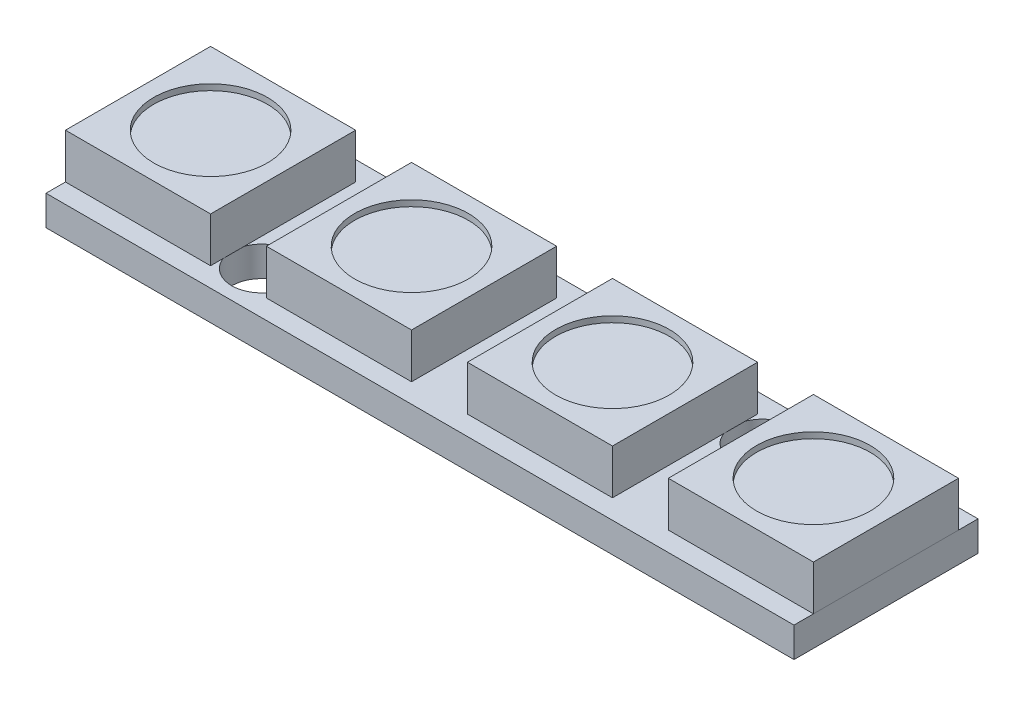
ISO-10303-21;
HEADER;
FILE_DESCRIPTION(('STEP AP214'),'2;1');
FILE_NAME('part.step','',(''),(''),'','','');
FILE_SCHEMA(('AUTOMOTIVE_DESIGN { 1 0 10303 214 1 1 1 1 }'));
ENDSEC;
DATA;
#1=APPLICATION_CONTEXT('core data for automotive mechanical design processes');
#2=APPLICATION_PROTOCOL_DEFINITION('international standard','automotive_design',2000,#1);
#3=PRODUCT_CONTEXT('',#1,'mechanical');
#4=PRODUCT('Part','Part','',(#3));
#5=PRODUCT_RELATED_PRODUCT_CATEGORY('part','',(#4));
#6=PRODUCT_DEFINITION_FORMATION('','',#4);
#7=PRODUCT_DEFINITION_CONTEXT('part definition',#1,'design');
#8=PRODUCT_DEFINITION('design','',#6,#7);
#9=PRODUCT_DEFINITION_SHAPE('','',#8);
#10=(LENGTH_UNIT() NAMED_UNIT(*) SI_UNIT(.MILLI.,.METRE.));
#11=(NAMED_UNIT(*) PLANE_ANGLE_UNIT() SI_UNIT($,.RADIAN.));
#12=(NAMED_UNIT(*) SI_UNIT($,.STERADIAN.) SOLID_ANGLE_UNIT());
#13=UNCERTAINTY_MEASURE_WITH_UNIT(LENGTH_MEASURE(1.E-05),#10,'distance_accuracy_value','');
#14=(GEOMETRIC_REPRESENTATION_CONTEXT(3) GLOBAL_UNCERTAINTY_ASSIGNED_CONTEXT((#13)) GLOBAL_UNIT_ASSIGNED_CONTEXT((#10,
#11,#12)) REPRESENTATION_CONTEXT('',''));
#15=CARTESIAN_POINT('',(0.,0.,0.));
#16=DIRECTION('',(0.,0.,1.));
#17=DIRECTION('',(1.,0.,0.));
#18=AXIS2_PLACEMENT_3D('',#15,#16,#17);
#19=CARTESIAN_POINT('',(7.65,2.5,2.425));
#20=DIRECTION('',(0.,0.,-1.));
#21=DIRECTION('',(-1.,0.,0.));
#22=AXIS2_PLACEMENT_3D('',#19,#20,#21);
#23=PLANE('',#22);
#24=DIRECTION('',(1.,0.,0.));
#25=VECTOR('',#24,1.);
#26=CARTESIAN_POINT('',(7.65,1.,2.425));
#27=LINE('',#26,#25);
#28=CARTESIAN_POINT('',(7.65,1.,2.425));
#29=VERTEX_POINT('',#28);
#30=CARTESIAN_POINT('',(12.5,1.,2.425));
#31=VERTEX_POINT('',#30);
#32=EDGE_CURVE('E111',#29,#31,#27,.T.);
#33=ORIENTED_EDGE('',*,*,#32,.T.);
#34=DIRECTION('',(0.,-1.,0.));
#35=VECTOR('',#34,1.);
#36=CARTESIAN_POINT('',(12.5,2.5,2.425));
#37=LINE('',#36,#35);
#38=CARTESIAN_POINT('',(12.5,2.5,2.425));
#39=VERTEX_POINT('',#38);
#40=EDGE_CURVE('E12',#39,#31,#37,.T.);
#41=ORIENTED_EDGE('',*,*,#40,.F.);
#42=DIRECTION('',(1.,0.,0.));
#43=VECTOR('',#42,1.);
#44=CARTESIAN_POINT('',(7.65,2.5,2.425));
#45=LINE('',#44,#43);
#46=CARTESIAN_POINT('',(7.65,2.5,2.425));
#47=VERTEX_POINT('',#46);
#48=EDGE_CURVE('E99',#47,#39,#45,.T.);
#49=ORIENTED_EDGE('',*,*,#48,.F.);
#50=DIRECTION('',(0.,-1.,0.));
#51=VECTOR('',#50,1.);
#52=CARTESIAN_POINT('',(7.65,2.5,2.425));
#53=LINE('',#52,#51);
#54=EDGE_CURVE('E107',#47,#29,#53,.T.);
#55=ORIENTED_EDGE('',*,*,#54,.T.);
#56=EDGE_LOOP('',(#33,#41,#49,#55));
#57=FACE_BOUND('',#56,.T.);
#58=ADVANCED_FACE('F48',(#57),#23,.F.);
#59=CARTESIAN_POINT('',(12.5,2.5,-2.425));
#60=DIRECTION('',(-1.,0.,0.));
#61=DIRECTION('',(0.,0.,1.));
#62=AXIS2_PLACEMENT_3D('',#59,#60,#61);
#63=PLANE('',#62);
#64=DIRECTION('',(0.,0.,-1.));
#65=VECTOR('',#64,1.);
#66=CARTESIAN_POINT('',(12.5,1.,-2.425));
#67=LINE('',#66,#65);
#68=CARTESIAN_POINT('',(12.5,1.,-2.425));
#69=VERTEX_POINT('',#68);
#70=EDGE_CURVE('E103',#31,#69,#67,.T.);
#71=ORIENTED_EDGE('',*,*,#70,.T.);
#72=DIRECTION('',(0.,-1.,0.));
#73=VECTOR('',#72,1.);
#74=CARTESIAN_POINT('',(12.5,2.5,-2.425));
#75=LINE('',#74,#73);
#76=CARTESIAN_POINT('',(12.5,2.5,-2.425));
#77=VERTEX_POINT('',#76);
#78=EDGE_CURVE('E56',#77,#69,#75,.T.);
#79=ORIENTED_EDGE('',*,*,#78,.F.);
#80=DIRECTION('',(0.,0.,-1.));
#81=VECTOR('',#80,1.);
#82=CARTESIAN_POINT('',(12.5,2.5,-2.425));
#83=LINE('',#82,#81);
#84=EDGE_CURVE('E94',#39,#77,#83,.T.);
#85=ORIENTED_EDGE('',*,*,#84,.F.);
#86=ORIENTED_EDGE('',*,*,#40,.T.);
#87=EDGE_LOOP('',(#71,#79,#85,#86));
#88=FACE_BOUND('',#87,.T.);
#89=ADVANCED_FACE('F102',(#88),#63,.F.);
#90=CARTESIAN_POINT('',(7.65,2.5,-2.425));
#91=DIRECTION('',(0.,0.,1.));
#92=DIRECTION('',(1.,0.,0.));
#93=AXIS2_PLACEMENT_3D('',#90,#91,#92);
#94=PLANE('',#93);
#95=DIRECTION('',(-1.,0.,0.));
#96=VECTOR('',#95,1.);
#97=CARTESIAN_POINT('',(7.65,1.,-2.425));
#98=LINE('',#97,#96);
#99=CARTESIAN_POINT('',(7.65,1.,-2.425));
#100=VERTEX_POINT('',#99);
#101=EDGE_CURVE('E81',#69,#100,#98,.T.);
#102=ORIENTED_EDGE('',*,*,#101,.T.);
#103=DIRECTION('',(0.,-1.,0.));
#104=VECTOR('',#103,1.);
#105=CARTESIAN_POINT('',(7.65,2.5,-2.425));
#106=LINE('',#105,#104);
#107=CARTESIAN_POINT('',(7.65,2.5,-2.425));
#108=VERTEX_POINT('',#107);
#109=EDGE_CURVE('E104',#108,#100,#106,.T.);
#110=ORIENTED_EDGE('',*,*,#109,.F.);
#111=DIRECTION('',(-1.,0.,0.));
#112=VECTOR('',#111,1.);
#113=CARTESIAN_POINT('',(7.65,2.5,-2.425));
#114=LINE('',#113,#112);
#115=EDGE_CURVE('E97',#77,#108,#114,.T.);
#116=ORIENTED_EDGE('',*,*,#115,.F.);
#117=ORIENTED_EDGE('',*,*,#78,.T.);
#118=EDGE_LOOP('',(#102,#110,#116,#117));
#119=FACE_BOUND('',#118,.T.);
#120=ADVANCED_FACE('F105',(#119),#94,.F.);
#121=CARTESIAN_POINT('',(7.65,2.5,-2.425));
#122=DIRECTION('',(1.,0.,0.));
#123=DIRECTION('',(0.,0.,-1.));
#124=AXIS2_PLACEMENT_3D('',#121,#122,#123);
#125=PLANE('',#124);
#126=DIRECTION('',(0.,0.,1.));
#127=VECTOR('',#126,1.);
#128=CARTESIAN_POINT('',(7.65,1.,-2.425));
#129=LINE('',#128,#127);
#130=EDGE_CURVE('E87',#100,#29,#129,.T.);
#131=ORIENTED_EDGE('',*,*,#130,.T.);
#132=ORIENTED_EDGE('',*,*,#54,.F.);
#133=DIRECTION('',(0.,0.,1.));
#134=VECTOR('',#133,1.);
#135=CARTESIAN_POINT('',(7.65,2.5,-2.425));
#136=LINE('',#135,#134);
#137=EDGE_CURVE('E64',#108,#47,#136,.T.);
#138=ORIENTED_EDGE('',*,*,#137,.F.);
#139=ORIENTED_EDGE('',*,*,#109,.T.);
#140=EDGE_LOOP('',(#131,#132,#138,#139));
#141=FACE_BOUND('',#140,.T.);
#142=ADVANCED_FACE('F119',(#141),#125,.F.);
#143=CARTESIAN_POINT('',(0.,2.5,0.));
#144=DIRECTION('',(0.,-1.,0.));
#145=DIRECTION('',(0.,0.,-1.));
#146=AXIS2_PLACEMENT_3D('',#143,#144,#145);
#147=PLANE('',#146);
#148=CARTESIAN_POINT('',(10.075,2.5,0.));
#149=DIRECTION('',(0.,1.,0.));
#150=DIRECTION('',(0.,0.,1.));
#151=AXIS2_PLACEMENT_3D('',#148,#149,#150);
#152=CIRCLE('',#151,1.9);
#153=CARTESIAN_POINT('',(10.075,2.5,1.9));
#154=VERTEX_POINT('',#153);
#155=EDGE_CURVE('E125',#154,#154,#152,.T.);
#156=ORIENTED_EDGE('',*,*,#155,.F.);
#157=EDGE_LOOP('',(#156));
#158=FACE_BOUND('',#157,.T.);
#159=ORIENTED_EDGE('',*,*,#48,.T.);
#160=ORIENTED_EDGE('',*,*,#84,.T.);
#161=ORIENTED_EDGE('',*,*,#115,.T.);
#162=ORIENTED_EDGE('',*,*,#137,.T.);
#163=EDGE_LOOP('',(#159,#160,#161,#162));
#164=FACE_BOUND('',#163,.T.);
#165=ADVANCED_FACE('F95',(#158,#164),#147,.F.);
#166=CARTESIAN_POINT('',(0.,1.,0.));
#167=DIRECTION('',(0.,-1.,0.));
#168=DIRECTION('',(0.,0.,-1.));
#169=AXIS2_PLACEMENT_3D('',#166,#167,#168);
#170=PLANE('',#169);
#171=ORIENTED_EDGE('',*,*,#32,.F.);
#172=ORIENTED_EDGE('',*,*,#130,.F.);
#173=ORIENTED_EDGE('',*,*,#101,.F.);
#174=ORIENTED_EDGE('',*,*,#70,.F.);
#175=EDGE_LOOP('',(#171,#172,#173,#174));
#176=FACE_BOUND('',#175,.T.);
#177=ADVANCED_FACE('F122',(#176),#170,.T.);
#178=CARTESIAN_POINT('',(10.075,2.3,0.));
#179=DIRECTION('',(0.,1.,0.));
#180=DIRECTION('',(0.,0.,1.));
#181=AXIS2_PLACEMENT_3D('',#178,#179,#180);
#182=CYLINDRICAL_SURFACE('',#181,1.9);
#183=CARTESIAN_POINT('',(10.075,2.3,0.));
#184=DIRECTION('',(0.,1.,0.));
#185=DIRECTION('',(0.,0.,1.));
#186=AXIS2_PLACEMENT_3D('',#183,#184,#185);
#187=CIRCLE('',#186,1.9);
#188=CARTESIAN_POINT('',(10.075,2.3,1.9));
#189=VERTEX_POINT('',#188);
#190=EDGE_CURVE('E114',#189,#189,#187,.T.);
#191=ORIENTED_EDGE('',*,*,#190,.F.);
#192=EDGE_LOOP('',(#191));
#193=FACE_BOUND('',#192,.T.);
#194=ORIENTED_EDGE('',*,*,#155,.T.);
#195=EDGE_LOOP('',(#194));
#196=FACE_BOUND('',#195,.T.);
#197=ADVANCED_FACE('F133',(#193,#196),#182,.F.);
#198=CARTESIAN_POINT('',(10.075,2.3,0.));
#199=DIRECTION('',(0.,1.,0.));
#200=DIRECTION('',(0.,0.,1.));
#201=AXIS2_PLACEMENT_3D('',#198,#199,#200);
#202=PLANE('',#201);
#203=ORIENTED_EDGE('',*,*,#190,.T.);
#204=EDGE_LOOP('',(#203));
#205=FACE_BOUND('',#204,.T.);
#206=ADVANCED_FACE('F131',(#205),#202,.T.);
#207=CLOSED_SHELL('',(#58,#89,#120,#142,#165,#177,#197,#206));
#208=MANIFOLD_SOLID_BREP('B2',#207);
#209=CARTESIAN_POINT('',(0.933333333333331,2.5,2.425));
#210=DIRECTION('',(0.,0.,-1.));
#211=DIRECTION('',(-1.,0.,0.));
#212=AXIS2_PLACEMENT_3D('',#209,#210,#211);
#213=PLANE('',#212);
#214=DIRECTION('',(1.,0.,0.));
#215=VECTOR('',#214,1.);
#216=CARTESIAN_POINT('',(0.933333333333331,1.,2.425));
#217=LINE('',#216,#215);
#218=CARTESIAN_POINT('',(0.933333333333331,1.,2.425));
#219=VERTEX_POINT('',#218);
#220=CARTESIAN_POINT('',(5.78333333333333,1.,2.425));
#221=VERTEX_POINT('',#220);
#222=EDGE_CURVE('E275',#219,#221,#217,.T.);
#223=ORIENTED_EDGE('',*,*,#222,.T.);
#224=DIRECTION('',(0.,-1.,0.));
#225=VECTOR('',#224,1.);
#226=CARTESIAN_POINT('',(5.78333333333333,2.5,2.425));
#227=LINE('',#226,#225);
#228=CARTESIAN_POINT('',(5.78333333333333,2.5,2.425));
#229=VERTEX_POINT('',#228);
#230=EDGE_CURVE('E46',#229,#221,#227,.T.);
#231=ORIENTED_EDGE('',*,*,#230,.F.);
#232=DIRECTION('',(1.,0.,0.));
#233=VECTOR('',#232,1.);
#234=CARTESIAN_POINT('',(0.933333333333331,2.5,2.425));
#235=LINE('',#234,#233);
#236=CARTESIAN_POINT('',(0.933333333333331,2.5,2.425));
#237=VERTEX_POINT('',#236);
#238=EDGE_CURVE('E263',#237,#229,#235,.T.);
#239=ORIENTED_EDGE('',*,*,#238,.F.);
#240=DIRECTION('',(0.,-1.,0.));
#241=VECTOR('',#240,1.);
#242=CARTESIAN_POINT('',(0.933333333333331,2.5,2.425));
#243=LINE('',#242,#241);
#244=EDGE_CURVE('E271',#237,#219,#243,.T.);
#245=ORIENTED_EDGE('',*,*,#244,.T.);
#246=EDGE_LOOP('',(#223,#231,#239,#245));
#247=FACE_BOUND('',#246,.T.);
#248=ADVANCED_FACE('F212',(#247),#213,.F.);
#249=CARTESIAN_POINT('',(5.78333333333333,2.5,-2.425));
#250=DIRECTION('',(-1.,0.,0.));
#251=DIRECTION('',(0.,0.,1.));
#252=AXIS2_PLACEMENT_3D('',#249,#250,#251);
#253=PLANE('',#252);
#254=DIRECTION('',(0.,0.,-1.));
#255=VECTOR('',#254,1.);
#256=CARTESIAN_POINT('',(5.78333333333333,1.,-2.425));
#257=LINE('',#256,#255);
#258=CARTESIAN_POINT('',(5.78333333333333,1.,-2.425));
#259=VERTEX_POINT('',#258);
#260=EDGE_CURVE('E267',#221,#259,#257,.T.);
#261=ORIENTED_EDGE('',*,*,#260,.T.);
#262=DIRECTION('',(0.,-1.,0.));
#263=VECTOR('',#262,1.);
#264=CARTESIAN_POINT('',(5.78333333333333,2.5,-2.425));
#265=LINE('',#264,#263);
#266=CARTESIAN_POINT('',(5.78333333333333,2.5,-2.425));
#267=VERTEX_POINT('',#266);
#268=EDGE_CURVE('E220',#267,#259,#265,.T.);
#269=ORIENTED_EDGE('',*,*,#268,.F.);
#270=DIRECTION('',(0.,0.,-1.));
#271=VECTOR('',#270,1.);
#272=CARTESIAN_POINT('',(5.78333333333333,2.5,-2.425));
#273=LINE('',#272,#271);
#274=EDGE_CURVE('E258',#229,#267,#273,.T.);
#275=ORIENTED_EDGE('',*,*,#274,.F.);
#276=ORIENTED_EDGE('',*,*,#230,.T.);
#277=EDGE_LOOP('',(#261,#269,#275,#276));
#278=FACE_BOUND('',#277,.T.);
#279=ADVANCED_FACE('F266',(#278),#253,.F.);
#280=CARTESIAN_POINT('',(0.933333333333333,2.5,-2.425));
#281=DIRECTION('',(0.,0.,1.));
#282=DIRECTION('',(1.,0.,0.));
#283=AXIS2_PLACEMENT_3D('',#280,#281,#282);
#284=PLANE('',#283);
#285=DIRECTION('',(-1.,0.,0.));
#286=VECTOR('',#285,1.);
#287=CARTESIAN_POINT('',(0.933333333333333,1.,-2.425));
#288=LINE('',#287,#286);
#289=CARTESIAN_POINT('',(0.933333333333333,1.,-2.425));
#290=VERTEX_POINT('',#289);
#291=EDGE_CURVE('E245',#259,#290,#288,.T.);
#292=ORIENTED_EDGE('',*,*,#291,.T.);
#293=DIRECTION('',(0.,-1.,0.));
#294=VECTOR('',#293,1.);
#295=CARTESIAN_POINT('',(0.933333333333333,2.5,-2.425));
#296=LINE('',#295,#294);
#297=CARTESIAN_POINT('',(0.933333333333333,2.5,-2.425));
#298=VERTEX_POINT('',#297);
#299=EDGE_CURVE('E268',#298,#290,#296,.T.);
#300=ORIENTED_EDGE('',*,*,#299,.F.);
#301=DIRECTION('',(-1.,0.,0.));
#302=VECTOR('',#301,1.);
#303=CARTESIAN_POINT('',(0.933333333333333,2.5,-2.425));
#304=LINE('',#303,#302);
#305=EDGE_CURVE('E261',#267,#298,#304,.T.);
#306=ORIENTED_EDGE('',*,*,#305,.F.);
#307=ORIENTED_EDGE('',*,*,#268,.T.);
#308=EDGE_LOOP('',(#292,#300,#306,#307));
#309=FACE_BOUND('',#308,.T.);
#310=ADVANCED_FACE('F269',(#309),#284,.F.);
#311=CARTESIAN_POINT('',(0.933333333333333,2.5,-2.425));
#312=DIRECTION('',(1.,0.,0.));
#313=DIRECTION('',(0.,0.,-1.));
#314=AXIS2_PLACEMENT_3D('',#311,#312,#313);
#315=PLANE('',#314);
#316=DIRECTION('',(0.,0.,1.));
#317=VECTOR('',#316,1.);
#318=CARTESIAN_POINT('',(0.933333333333333,1.,-2.425));
#319=LINE('',#318,#317);
#320=EDGE_CURVE('E251',#290,#219,#319,.T.);
#321=ORIENTED_EDGE('',*,*,#320,.T.);
#322=ORIENTED_EDGE('',*,*,#244,.F.);
#323=DIRECTION('',(0.,0.,1.));
#324=VECTOR('',#323,1.);
#325=CARTESIAN_POINT('',(0.933333333333333,2.5,-2.425));
#326=LINE('',#325,#324);
#327=EDGE_CURVE('E228',#298,#237,#326,.T.);
#328=ORIENTED_EDGE('',*,*,#327,.F.);
#329=ORIENTED_EDGE('',*,*,#299,.T.);
#330=EDGE_LOOP('',(#321,#322,#328,#329));
#331=FACE_BOUND('',#330,.T.);
#332=ADVANCED_FACE('F283',(#331),#315,.F.);
#333=CARTESIAN_POINT('',(0.,2.5,0.));
#334=DIRECTION('',(0.,-1.,0.));
#335=DIRECTION('',(0.,0.,-1.));
#336=AXIS2_PLACEMENT_3D('',#333,#334,#335);
#337=PLANE('',#336);
#338=CARTESIAN_POINT('',(3.35833333333333,2.5,0.));
#339=DIRECTION('',(0.,1.,0.));
#340=DIRECTION('',(0.,0.,1.));
#341=AXIS2_PLACEMENT_3D('',#338,#339,#340);
#342=CIRCLE('',#341,1.9);
#343=CARTESIAN_POINT('',(3.35833333333333,2.5,1.9));
#344=VERTEX_POINT('',#343);
#345=EDGE_CURVE('E289',#344,#344,#342,.T.);
#346=ORIENTED_EDGE('',*,*,#345,.F.);
#347=EDGE_LOOP('',(#346));
#348=FACE_BOUND('',#347,.T.);
#349=ORIENTED_EDGE('',*,*,#238,.T.);
#350=ORIENTED_EDGE('',*,*,#274,.T.);
#351=ORIENTED_EDGE('',*,*,#305,.T.);
#352=ORIENTED_EDGE('',*,*,#327,.T.);
#353=EDGE_LOOP('',(#349,#350,#351,#352));
#354=FACE_BOUND('',#353,.T.);
#355=ADVANCED_FACE('F259',(#348,#354),#337,.F.);
#356=CARTESIAN_POINT('',(0.,1.,0.));
#357=DIRECTION('',(0.,-1.,0.));
#358=DIRECTION('',(0.,0.,-1.));
#359=AXIS2_PLACEMENT_3D('',#356,#357,#358);
#360=PLANE('',#359);
#361=ORIENTED_EDGE('',*,*,#222,.F.);
#362=ORIENTED_EDGE('',*,*,#320,.F.);
#363=ORIENTED_EDGE('',*,*,#291,.F.);
#364=ORIENTED_EDGE('',*,*,#260,.F.);
#365=EDGE_LOOP('',(#361,#362,#363,#364));
#366=FACE_BOUND('',#365,.T.);
#367=ADVANCED_FACE('F286',(#366),#360,.T.);
#368=CARTESIAN_POINT('',(3.35833333333333,2.3,0.));
#369=DIRECTION('',(0.,1.,0.));
#370=DIRECTION('',(0.,0.,1.));
#371=AXIS2_PLACEMENT_3D('',#368,#369,#370);
#372=CYLINDRICAL_SURFACE('',#371,1.9);
#373=CARTESIAN_POINT('',(3.35833333333333,2.3,0.));
#374=DIRECTION('',(0.,1.,0.));
#375=DIRECTION('',(0.,0.,1.));
#376=AXIS2_PLACEMENT_3D('',#373,#374,#375);
#377=CIRCLE('',#376,1.9);
#378=CARTESIAN_POINT('',(3.35833333333333,2.3,1.9));
#379=VERTEX_POINT('',#378);
#380=EDGE_CURVE('E278',#379,#379,#377,.T.);
#381=ORIENTED_EDGE('',*,*,#380,.F.);
#382=EDGE_LOOP('',(#381));
#383=FACE_BOUND('',#382,.T.);
#384=ORIENTED_EDGE('',*,*,#345,.T.);
#385=EDGE_LOOP('',(#384));
#386=FACE_BOUND('',#385,.T.);
#387=ADVANCED_FACE('F297',(#383,#386),#372,.F.);
#388=CARTESIAN_POINT('',(3.35833333333333,2.3,0.));
#389=DIRECTION('',(0.,1.,0.));
#390=DIRECTION('',(0.,0.,1.));
#391=AXIS2_PLACEMENT_3D('',#388,#389,#390);
#392=PLANE('',#391);
#393=ORIENTED_EDGE('',*,*,#380,.T.);
#394=EDGE_LOOP('',(#393));
#395=FACE_BOUND('',#394,.T.);
#396=ADVANCED_FACE('F295',(#395),#392,.T.);
#397=CLOSED_SHELL('',(#248,#279,#310,#332,#355,#367,#387,#396));
#398=MANIFOLD_SOLID_BREP('B6',#397);
#399=CARTESIAN_POINT('',(-5.78333333333334,2.5,2.425));
#400=DIRECTION('',(0.,0.,-1.));
#401=DIRECTION('',(-1.,0.,0.));
#402=AXIS2_PLACEMENT_3D('',#399,#400,#401);
#403=PLANE('',#402);
#404=DIRECTION('',(1.,0.,0.));
#405=VECTOR('',#404,1.);
#406=CARTESIAN_POINT('',(-5.78333333333334,1.,2.425));
#407=LINE('',#406,#405);
#408=CARTESIAN_POINT('',(-5.78333333333334,1.,2.425));
#409=VERTEX_POINT('',#408);
#410=CARTESIAN_POINT('',(-0.933333333333334,1.,2.425));
#411=VERTEX_POINT('',#410);
#412=EDGE_CURVE('E439',#409,#411,#407,.T.);
#413=ORIENTED_EDGE('',*,*,#412,.T.);
#414=DIRECTION('',(0.,-1.,0.));
#415=VECTOR('',#414,1.);
#416=CARTESIAN_POINT('',(-0.933333333333334,2.5,2.425));
#417=LINE('',#416,#415);
#418=CARTESIAN_POINT('',(-0.933333333333334,2.5,2.425));
#419=VERTEX_POINT('',#418);
#420=EDGE_CURVE('E210',#419,#411,#417,.T.);
#421=ORIENTED_EDGE('',*,*,#420,.F.);
#422=DIRECTION('',(1.,0.,0.));
#423=VECTOR('',#422,1.);
#424=CARTESIAN_POINT('',(-5.78333333333334,2.5,2.425));
#425=LINE('',#424,#423);
#426=CARTESIAN_POINT('',(-5.78333333333334,2.5,2.425));
#427=VERTEX_POINT('',#426);
#428=EDGE_CURVE('E427',#427,#419,#425,.T.);
#429=ORIENTED_EDGE('',*,*,#428,.F.);
#430=DIRECTION('',(0.,-1.,0.));
#431=VECTOR('',#430,1.);
#432=CARTESIAN_POINT('',(-5.78333333333334,2.5,2.425));
#433=LINE('',#432,#431);
#434=EDGE_CURVE('E435',#427,#409,#433,.T.);
#435=ORIENTED_EDGE('',*,*,#434,.T.);
#436=EDGE_LOOP('',(#413,#421,#429,#435));
#437=FACE_BOUND('',#436,.T.);
#438=ADVANCED_FACE('F376',(#437),#403,.F.);
#439=CARTESIAN_POINT('',(-0.933333333333335,2.5,-2.425));
#440=DIRECTION('',(-1.,0.,0.));
#441=DIRECTION('',(0.,0.,1.));
#442=AXIS2_PLACEMENT_3D('',#439,#440,#441);
#443=PLANE('',#442);
#444=DIRECTION('',(0.,0.,-1.));
#445=VECTOR('',#444,1.);
#446=CARTESIAN_POINT('',(-0.933333333333335,1.,-2.425));
#447=LINE('',#446,#445);
#448=CARTESIAN_POINT('',(-0.933333333333335,1.,-2.425));
#449=VERTEX_POINT('',#448);
#450=EDGE_CURVE('E431',#411,#449,#447,.T.);
#451=ORIENTED_EDGE('',*,*,#450,.T.);
#452=DIRECTION('',(0.,-1.,0.));
#453=VECTOR('',#452,1.);
#454=CARTESIAN_POINT('',(-0.933333333333335,2.5,-2.425));
#455=LINE('',#454,#453);
#456=CARTESIAN_POINT('',(-0.933333333333335,2.5,-2.425));
#457=VERTEX_POINT('',#456);
#458=EDGE_CURVE('E384',#457,#449,#455,.T.);
#459=ORIENTED_EDGE('',*,*,#458,.F.);
#460=DIRECTION('',(0.,0.,-1.));
#461=VECTOR('',#460,1.);
#462=CARTESIAN_POINT('',(-0.933333333333335,2.5,-2.425));
#463=LINE('',#462,#461);
#464=EDGE_CURVE('E422',#419,#457,#463,.T.);
#465=ORIENTED_EDGE('',*,*,#464,.F.);
#466=ORIENTED_EDGE('',*,*,#420,.T.);
#467=EDGE_LOOP('',(#451,#459,#465,#466));
#468=FACE_BOUND('',#467,.T.);
#469=ADVANCED_FACE('F430',(#468),#443,.F.);
#470=CARTESIAN_POINT('',(-5.78333333333333,2.5,-2.425));
#471=DIRECTION('',(0.,0.,1.));
#472=DIRECTION('',(1.,0.,0.));
#473=AXIS2_PLACEMENT_3D('',#470,#471,#472);
#474=PLANE('',#473);
#475=DIRECTION('',(-1.,0.,0.));
#476=VECTOR('',#475,1.);
#477=CARTESIAN_POINT('',(-5.78333333333333,1.,-2.425));
#478=LINE('',#477,#476);
#479=CARTESIAN_POINT('',(-5.78333333333333,1.,-2.425));
#480=VERTEX_POINT('',#479);
#481=EDGE_CURVE('E409',#449,#480,#478,.T.);
#482=ORIENTED_EDGE('',*,*,#481,.T.);
#483=DIRECTION('',(0.,-1.,0.));
#484=VECTOR('',#483,1.);
#485=CARTESIAN_POINT('',(-5.78333333333333,2.5,-2.425));
#486=LINE('',#485,#484);
#487=CARTESIAN_POINT('',(-5.78333333333333,2.5,-2.425));
#488=VERTEX_POINT('',#487);
#489=EDGE_CURVE('E432',#488,#480,#486,.T.);
#490=ORIENTED_EDGE('',*,*,#489,.F.);
#491=DIRECTION('',(-1.,0.,0.));
#492=VECTOR('',#491,1.);
#493=CARTESIAN_POINT('',(-5.78333333333333,2.5,-2.425));
#494=LINE('',#493,#492);
#495=EDGE_CURVE('E425',#457,#488,#494,.T.);
#496=ORIENTED_EDGE('',*,*,#495,.F.);
#497=ORIENTED_EDGE('',*,*,#458,.T.);
#498=EDGE_LOOP('',(#482,#490,#496,#497));
#499=FACE_BOUND('',#498,.T.);
#500=ADVANCED_FACE('F433',(#499),#474,.F.);
#501=CARTESIAN_POINT('',(-5.78333333333333,2.5,-2.425));
#502=DIRECTION('',(1.,0.,0.));
#503=DIRECTION('',(0.,0.,-1.));
#504=AXIS2_PLACEMENT_3D('',#501,#502,#503);
#505=PLANE('',#504);
#506=DIRECTION('',(0.,0.,1.));
#507=VECTOR('',#506,1.);
#508=CARTESIAN_POINT('',(-5.78333333333333,1.,-2.425));
#509=LINE('',#508,#507);
#510=EDGE_CURVE('E415',#480,#409,#509,.T.);
#511=ORIENTED_EDGE('',*,*,#510,.T.);
#512=ORIENTED_EDGE('',*,*,#434,.F.);
#513=DIRECTION('',(0.,0.,1.));
#514=VECTOR('',#513,1.);
#515=CARTESIAN_POINT('',(-5.78333333333333,2.5,-2.425));
#516=LINE('',#515,#514);
#517=EDGE_CURVE('E392',#488,#427,#516,.T.);
#518=ORIENTED_EDGE('',*,*,#517,.F.);
#519=ORIENTED_EDGE('',*,*,#489,.T.);
#520=EDGE_LOOP('',(#511,#512,#518,#519));
#521=FACE_BOUND('',#520,.T.);
#522=ADVANCED_FACE('F447',(#521),#505,.F.);
#523=CARTESIAN_POINT('',(0.,2.5,0.));
#524=DIRECTION('',(0.,-1.,0.));
#525=DIRECTION('',(0.,0.,-1.));
#526=AXIS2_PLACEMENT_3D('',#523,#524,#525);
#527=PLANE('',#526);
#528=CARTESIAN_POINT('',(-3.35833333333333,2.5,0.));
#529=DIRECTION('',(0.,1.,0.));
#530=DIRECTION('',(0.,0.,1.));
#531=AXIS2_PLACEMENT_3D('',#528,#529,#530);
#532=CIRCLE('',#531,1.9);
#533=CARTESIAN_POINT('',(-3.35833333333333,2.5,1.9));
#534=VERTEX_POINT('',#533);
#535=EDGE_CURVE('E453',#534,#534,#532,.T.);
#536=ORIENTED_EDGE('',*,*,#535,.F.);
#537=EDGE_LOOP('',(#536));
#538=FACE_BOUND('',#537,.T.);
#539=ORIENTED_EDGE('',*,*,#428,.T.);
#540=ORIENTED_EDGE('',*,*,#464,.T.);
#541=ORIENTED_EDGE('',*,*,#495,.T.);
#542=ORIENTED_EDGE('',*,*,#517,.T.);
#543=EDGE_LOOP('',(#539,#540,#541,#542));
#544=FACE_BOUND('',#543,.T.);
#545=ADVANCED_FACE('F423',(#538,#544),#527,.F.);
#546=CARTESIAN_POINT('',(0.,1.,0.));
#547=DIRECTION('',(0.,-1.,0.));
#548=DIRECTION('',(0.,0.,-1.));
#549=AXIS2_PLACEMENT_3D('',#546,#547,#548);
#550=PLANE('',#549);
#551=ORIENTED_EDGE('',*,*,#412,.F.);
#552=ORIENTED_EDGE('',*,*,#510,.F.);
#553=ORIENTED_EDGE('',*,*,#481,.F.);
#554=ORIENTED_EDGE('',*,*,#450,.F.);
#555=EDGE_LOOP('',(#551,#552,#553,#554));
#556=FACE_BOUND('',#555,.T.);
#557=ADVANCED_FACE('F450',(#556),#550,.T.);
#558=CARTESIAN_POINT('',(-3.35833333333333,2.3,0.));
#559=DIRECTION('',(0.,1.,0.));
#560=DIRECTION('',(0.,0.,1.));
#561=AXIS2_PLACEMENT_3D('',#558,#559,#560);
#562=CYLINDRICAL_SURFACE('',#561,1.9);
#563=CARTESIAN_POINT('',(-3.35833333333333,2.3,0.));
#564=DIRECTION('',(0.,1.,0.));
#565=DIRECTION('',(0.,0.,1.));
#566=AXIS2_PLACEMENT_3D('',#563,#564,#565);
#567=CIRCLE('',#566,1.9);
#568=CARTESIAN_POINT('',(-3.35833333333333,2.3,1.9));
#569=VERTEX_POINT('',#568);
#570=EDGE_CURVE('E442',#569,#569,#567,.T.);
#571=ORIENTED_EDGE('',*,*,#570,.F.);
#572=EDGE_LOOP('',(#571));
#573=FACE_BOUND('',#572,.T.);
#574=ORIENTED_EDGE('',*,*,#535,.T.);
#575=EDGE_LOOP('',(#574));
#576=FACE_BOUND('',#575,.T.);
#577=ADVANCED_FACE('F461',(#573,#576),#562,.F.);
#578=CARTESIAN_POINT('',(-3.35833333333333,2.3,0.));
#579=DIRECTION('',(0.,1.,0.));
#580=DIRECTION('',(0.,0.,1.));
#581=AXIS2_PLACEMENT_3D('',#578,#579,#580);
#582=PLANE('',#581);
#583=ORIENTED_EDGE('',*,*,#570,.T.);
#584=EDGE_LOOP('',(#583));
#585=FACE_BOUND('',#584,.T.);
#586=ADVANCED_FACE('F459',(#585),#582,.T.);
#587=CLOSED_SHELL('',(#438,#469,#500,#522,#545,#557,#577,#586));
#588=MANIFOLD_SOLID_BREP('B40',#587);
#589=CARTESIAN_POINT('',(-7.65,2.5,-2.425));
#590=DIRECTION('',(-1.,0.,0.));
#591=DIRECTION('',(0.,0.,1.));
#592=AXIS2_PLACEMENT_3D('',#589,#590,#591);
#593=PLANE('',#592);
#594=DIRECTION('',(0.,0.,-1.));
#595=VECTOR('',#594,1.);
#596=CARTESIAN_POINT('',(-7.65,1.,-2.425));
#597=LINE('',#596,#595);
#598=CARTESIAN_POINT('',(-7.65,1.,2.425));
#599=VERTEX_POINT('',#598);
#600=CARTESIAN_POINT('',(-7.65,1.,-2.425));
#601=VERTEX_POINT('',#600);
#602=EDGE_CURVE('E602',#599,#601,#597,.T.);
#603=ORIENTED_EDGE('',*,*,#602,.T.);
#604=DIRECTION('',(0.,-1.,0.));
#605=VECTOR('',#604,1.);
#606=CARTESIAN_POINT('',(-7.65,2.5,-2.425));
#607=LINE('',#606,#605);
#608=CARTESIAN_POINT('',(-7.65,2.5,-2.425));
#609=VERTEX_POINT('',#608);
#610=EDGE_CURVE('E374',#609,#601,#607,.T.);
#611=ORIENTED_EDGE('',*,*,#610,.F.);
#612=DIRECTION('',(0.,0.,-1.));
#613=VECTOR('',#612,1.);
#614=CARTESIAN_POINT('',(-7.65,2.5,-2.425));
#615=LINE('',#614,#613);
#616=CARTESIAN_POINT('',(-7.65,2.5,2.425));
#617=VERTEX_POINT('',#616);
#618=EDGE_CURVE('E590',#617,#609,#615,.T.);
#619=ORIENTED_EDGE('',*,*,#618,.F.);
#620=DIRECTION('',(0.,-1.,0.));
#621=VECTOR('',#620,1.);
#622=CARTESIAN_POINT('',(-7.65,2.5,2.425));
#623=LINE('',#622,#621);
#624=EDGE_CURVE('E598',#617,#599,#623,.T.);
#625=ORIENTED_EDGE('',*,*,#624,.T.);
#626=EDGE_LOOP('',(#603,#611,#619,#625));
#627=FACE_BOUND('',#626,.T.);
#628=ADVANCED_FACE('F539',(#627),#593,.F.);
#629=CARTESIAN_POINT('',(-12.5,2.5,-2.425));
#630=DIRECTION('',(0.,0.,1.));
#631=DIRECTION('',(1.,0.,0.));
#632=AXIS2_PLACEMENT_3D('',#629,#630,#631);
#633=PLANE('',#632);
#634=DIRECTION('',(-1.,0.,0.));
#635=VECTOR('',#634,1.);
#636=CARTESIAN_POINT('',(-12.5,1.,-2.425));
#637=LINE('',#636,#635);
#638=CARTESIAN_POINT('',(-12.5,1.,-2.425));
#639=VERTEX_POINT('',#638);
#640=EDGE_CURVE('E594',#601,#639,#637,.T.);
#641=ORIENTED_EDGE('',*,*,#640,.T.);
#642=DIRECTION('',(0.,-1.,0.));
#643=VECTOR('',#642,1.);
#644=CARTESIAN_POINT('',(-12.5,2.5,-2.425));
#645=LINE('',#644,#643);
#646=CARTESIAN_POINT('',(-12.5,2.5,-2.425));
#647=VERTEX_POINT('',#646);
#648=EDGE_CURVE('E547',#647,#639,#645,.T.);
#649=ORIENTED_EDGE('',*,*,#648,.F.);
#650=DIRECTION('',(-1.,0.,0.));
#651=VECTOR('',#650,1.);
#652=CARTESIAN_POINT('',(-12.5,2.5,-2.425));
#653=LINE('',#652,#651);
#654=EDGE_CURVE('E585',#609,#647,#653,.T.);
#655=ORIENTED_EDGE('',*,*,#654,.F.);
#656=ORIENTED_EDGE('',*,*,#610,.T.);
#657=EDGE_LOOP('',(#641,#649,#655,#656));
#658=FACE_BOUND('',#657,.T.);
#659=ADVANCED_FACE('F593',(#658),#633,.F.);
#660=CARTESIAN_POINT('',(-12.5,2.5,-2.425));
#661=DIRECTION('',(1.,0.,0.));
#662=DIRECTION('',(0.,0.,-1.));
#663=AXIS2_PLACEMENT_3D('',#660,#661,#662);
#664=PLANE('',#663);
#665=DIRECTION('',(0.,0.,1.));
#666=VECTOR('',#665,1.);
#667=CARTESIAN_POINT('',(-12.5,1.,-2.425));
#668=LINE('',#667,#666);
#669=CARTESIAN_POINT('',(-12.5,1.,2.425));
#670=VERTEX_POINT('',#669);
#671=EDGE_CURVE('E572',#639,#670,#668,.T.);
#672=ORIENTED_EDGE('',*,*,#671,.T.);
#673=DIRECTION('',(0.,-1.,0.));
#674=VECTOR('',#673,1.);
#675=CARTESIAN_POINT('',(-12.5,2.5,2.425));
#676=LINE('',#675,#674);
#677=CARTESIAN_POINT('',(-12.5,2.5,2.425));
#678=VERTEX_POINT('',#677);
#679=EDGE_CURVE('E595',#678,#670,#676,.T.);
#680=ORIENTED_EDGE('',*,*,#679,.F.);
#681=DIRECTION('',(0.,0.,1.));
#682=VECTOR('',#681,1.);
#683=CARTESIAN_POINT('',(-12.5,2.5,-2.425));
#684=LINE('',#683,#682);
#685=EDGE_CURVE('E588',#647,#678,#684,.T.);
#686=ORIENTED_EDGE('',*,*,#685,.F.);
#687=ORIENTED_EDGE('',*,*,#648,.T.);
#688=EDGE_LOOP('',(#672,#680,#686,#687));
#689=FACE_BOUND('',#688,.T.);
#690=ADVANCED_FACE('F596',(#689),#664,.F.);
#691=CARTESIAN_POINT('',(-12.5,2.5,2.425));
#692=DIRECTION('',(0.,0.,-1.));
#693=DIRECTION('',(-1.,0.,0.));
#694=AXIS2_PLACEMENT_3D('',#691,#692,#693);
#695=PLANE('',#694);
#696=DIRECTION('',(1.,0.,0.));
#697=VECTOR('',#696,1.);
#698=CARTESIAN_POINT('',(-12.5,1.,2.425));
#699=LINE('',#698,#697);
#700=EDGE_CURVE('E578',#670,#599,#699,.T.);
#701=ORIENTED_EDGE('',*,*,#700,.T.);
#702=ORIENTED_EDGE('',*,*,#624,.F.);
#703=DIRECTION('',(1.,0.,0.));
#704=VECTOR('',#703,1.);
#705=CARTESIAN_POINT('',(-12.5,2.5,2.425));
#706=LINE('',#705,#704);
#707=EDGE_CURVE('E555',#678,#617,#706,.T.);
#708=ORIENTED_EDGE('',*,*,#707,.F.);
#709=ORIENTED_EDGE('',*,*,#679,.T.);
#710=EDGE_LOOP('',(#701,#702,#708,#709));
#711=FACE_BOUND('',#710,.T.);
#712=ADVANCED_FACE('F610',(#711),#695,.F.);
#713=CARTESIAN_POINT('',(0.,2.5,0.));
#714=DIRECTION('',(0.,1.,0.));
#715=DIRECTION('',(0.,0.,1.));
#716=AXIS2_PLACEMENT_3D('',#713,#714,#715);
#717=PLANE('',#716);
#718=CARTESIAN_POINT('',(-10.075,2.5,0.));
#719=DIRECTION('',(0.,1.,0.));
#720=DIRECTION('',(0.,0.,1.));
#721=AXIS2_PLACEMENT_3D('',#718,#719,#720);
#722=CIRCLE('',#721,1.9);
#723=CARTESIAN_POINT('',(-10.075,2.5,1.9));
#724=VERTEX_POINT('',#723);
#725=EDGE_CURVE('E616',#724,#724,#722,.T.);
#726=ORIENTED_EDGE('',*,*,#725,.F.);
#727=EDGE_LOOP('',(#726));
#728=FACE_BOUND('',#727,.T.);
#729=ORIENTED_EDGE('',*,*,#618,.T.);
#730=ORIENTED_EDGE('',*,*,#654,.T.);
#731=ORIENTED_EDGE('',*,*,#685,.T.);
#732=ORIENTED_EDGE('',*,*,#707,.T.);
#733=EDGE_LOOP('',(#729,#730,#731,#732));
#734=FACE_BOUND('',#733,.T.);
#735=ADVANCED_FACE('F586',(#728,#734),#717,.T.);
#736=CARTESIAN_POINT('',(0.,1.,0.));
#737=DIRECTION('',(0.,1.,0.));
#738=DIRECTION('',(0.,0.,1.));
#739=AXIS2_PLACEMENT_3D('',#736,#737,#738);
#740=PLANE('',#739);
#741=ORIENTED_EDGE('',*,*,#602,.F.);
#742=ORIENTED_EDGE('',*,*,#700,.F.);
#743=ORIENTED_EDGE('',*,*,#671,.F.);
#744=ORIENTED_EDGE('',*,*,#640,.F.);
#745=EDGE_LOOP('',(#741,#742,#743,#744));
#746=FACE_BOUND('',#745,.T.);
#747=ADVANCED_FACE('F613',(#746),#740,.F.);
#748=CARTESIAN_POINT('',(-10.075,2.3,0.));
#749=DIRECTION('',(0.,1.,0.));
#750=DIRECTION('',(0.,0.,1.));
#751=AXIS2_PLACEMENT_3D('',#748,#749,#750);
#752=CYLINDRICAL_SURFACE('',#751,1.9);
#753=CARTESIAN_POINT('',(-10.075,2.3,0.));
#754=DIRECTION('',(0.,1.,0.));
#755=DIRECTION('',(0.,0.,1.));
#756=AXIS2_PLACEMENT_3D('',#753,#754,#755);
#757=CIRCLE('',#756,1.9);
#758=CARTESIAN_POINT('',(-10.075,2.3,1.9));
#759=VERTEX_POINT('',#758);
#760=EDGE_CURVE('E605',#759,#759,#757,.T.);
#761=ORIENTED_EDGE('',*,*,#760,.F.);
#762=EDGE_LOOP('',(#761));
#763=FACE_BOUND('',#762,.T.);
#764=ORIENTED_EDGE('',*,*,#725,.T.);
#765=EDGE_LOOP('',(#764));
#766=FACE_BOUND('',#765,.T.);
#767=ADVANCED_FACE('F624',(#763,#766),#752,.F.);
#768=CARTESIAN_POINT('',(-10.075,2.3,0.));
#769=DIRECTION('',(0.,1.,0.));
#770=DIRECTION('',(0.,0.,1.));
#771=AXIS2_PLACEMENT_3D('',#768,#769,#770);
#772=PLANE('',#771);
#773=ORIENTED_EDGE('',*,*,#760,.T.);
#774=EDGE_LOOP('',(#773));
#775=FACE_BOUND('',#774,.T.);
#776=ADVANCED_FACE('F622',(#775),#772,.T.);
#777=CLOSED_SHELL('',(#628,#659,#690,#712,#735,#747,#767,#776));
#778=MANIFOLD_SOLID_BREP('B204',#777);
#779=CARTESIAN_POINT('',(12.5,1.,-3.075));
#780=DIRECTION('',(-1.,0.,0.));
#781=DIRECTION('',(0.,0.,1.));
#782=AXIS2_PLACEMENT_3D('',#779,#780,#781);
#783=PLANE('',#782);
#784=DIRECTION('',(0.,0.,-1.));
#785=VECTOR('',#784,1.);
#786=CARTESIAN_POINT('',(12.5,0.,-3.075));
#787=LINE('',#786,#785);
#788=CARTESIAN_POINT('',(12.5,0.,3.075));
#789=VERTEX_POINT('',#788);
#790=CARTESIAN_POINT('',(12.5,0.,-3.075));
#791=VERTEX_POINT('',#790);
#792=EDGE_CURVE('E756',#789,#791,#787,.T.);
#793=ORIENTED_EDGE('',*,*,#792,.T.);
#794=DIRECTION('',(0.,-1.,0.));
#795=VECTOR('',#794,1.);
#796=CARTESIAN_POINT('',(12.5,1.,-3.075));
#797=LINE('',#796,#795);
#798=CARTESIAN_POINT('',(12.5,1.,-3.075));
#799=VERTEX_POINT('',#798);
#800=EDGE_CURVE('E537',#799,#791,#797,.T.);
#801=ORIENTED_EDGE('',*,*,#800,.F.);
#802=DIRECTION('',(0.,0.,-1.));
#803=VECTOR('',#802,1.);
#804=CARTESIAN_POINT('',(12.5,1.,-3.075));
#805=LINE('',#804,#803);
#806=CARTESIAN_POINT('',(12.5,1.,3.075));
#807=VERTEX_POINT('',#806);
#808=EDGE_CURVE('E744',#807,#799,#805,.T.);
#809=ORIENTED_EDGE('',*,*,#808,.F.);
#810=DIRECTION('',(0.,-1.,0.));
#811=VECTOR('',#810,1.);
#812=CARTESIAN_POINT('',(12.5,1.,3.075));
#813=LINE('',#812,#811);
#814=EDGE_CURVE('E752',#807,#789,#813,.T.);
#815=ORIENTED_EDGE('',*,*,#814,.T.);
#816=EDGE_LOOP('',(#793,#801,#809,#815));
#817=FACE_BOUND('',#816,.T.);
#818=ADVANCED_FACE('F693',(#817),#783,.F.);
#819=CARTESIAN_POINT('',(-12.5,1.,-3.075));
#820=DIRECTION('',(0.,0.,1.));
#821=DIRECTION('',(1.,0.,0.));
#822=AXIS2_PLACEMENT_3D('',#819,#820,#821);
#823=PLANE('',#822);
#824=DIRECTION('',(-1.,0.,0.));
#825=VECTOR('',#824,1.);
#826=CARTESIAN_POINT('',(-12.5,0.,-3.075));
#827=LINE('',#826,#825);
#828=CARTESIAN_POINT('',(-12.5,0.,-3.075));
#829=VERTEX_POINT('',#828);
#830=EDGE_CURVE('E748',#791,#829,#827,.T.);
#831=ORIENTED_EDGE('',*,*,#830,.T.);
#832=DIRECTION('',(0.,-1.,0.));
#833=VECTOR('',#832,1.);
#834=CARTESIAN_POINT('',(-12.5,1.,-3.075));
#835=LINE('',#834,#833);
#836=CARTESIAN_POINT('',(-12.5,1.,-3.075));
#837=VERTEX_POINT('',#836);
#838=EDGE_CURVE('E701',#837,#829,#835,.T.);
#839=ORIENTED_EDGE('',*,*,#838,.F.);
#840=DIRECTION('',(-1.,0.,0.));
#841=VECTOR('',#840,1.);
#842=CARTESIAN_POINT('',(-12.5,1.,-3.075));
#843=LINE('',#842,#841);
#844=EDGE_CURVE('E739',#799,#837,#843,.T.);
#845=ORIENTED_EDGE('',*,*,#844,.F.);
#846=ORIENTED_EDGE('',*,*,#800,.T.);
#847=EDGE_LOOP('',(#831,#839,#845,#846));
#848=FACE_BOUND('',#847,.T.);
#849=ADVANCED_FACE('F747',(#848),#823,.F.);
#850=CARTESIAN_POINT('',(-12.5,1.,-3.075));
#851=DIRECTION('',(1.,0.,0.));
#852=DIRECTION('',(0.,0.,-1.));
#853=AXIS2_PLACEMENT_3D('',#850,#851,#852);
#854=PLANE('',#853);
#855=DIRECTION('',(0.,0.,1.));
#856=VECTOR('',#855,1.);
#857=CARTESIAN_POINT('',(-12.5,0.,-3.075));
#858=LINE('',#857,#856);
#859=CARTESIAN_POINT('',(-12.5,0.,3.075));
#860=VERTEX_POINT('',#859);
#861=EDGE_CURVE('E726',#829,#860,#858,.T.);
#862=ORIENTED_EDGE('',*,*,#861,.T.);
#863=DIRECTION('',(0.,-1.,0.));
#864=VECTOR('',#863,1.);
#865=CARTESIAN_POINT('',(-12.5,1.,3.075));
#866=LINE('',#865,#864);
#867=CARTESIAN_POINT('',(-12.5,1.,3.075));
#868=VERTEX_POINT('',#867);
#869=EDGE_CURVE('E749',#868,#860,#866,.T.);
#870=ORIENTED_EDGE('',*,*,#869,.F.);
#871=DIRECTION('',(0.,0.,1.));
#872=VECTOR('',#871,1.);
#873=CARTESIAN_POINT('',(-12.5,1.,-3.075));
#874=LINE('',#873,#872);
#875=EDGE_CURVE('E742',#837,#868,#874,.T.);
#876=ORIENTED_EDGE('',*,*,#875,.F.);
#877=ORIENTED_EDGE('',*,*,#838,.T.);
#878=EDGE_LOOP('',(#862,#870,#876,#877));
#879=FACE_BOUND('',#878,.T.);
#880=ADVANCED_FACE('F750',(#879),#854,.F.);
#881=CARTESIAN_POINT('',(-12.5,1.,3.075));
#882=DIRECTION('',(0.,0.,-1.));
#883=DIRECTION('',(-1.,0.,0.));
#884=AXIS2_PLACEMENT_3D('',#881,#882,#883);
#885=PLANE('',#884);
#886=DIRECTION('',(1.,0.,0.));
#887=VECTOR('',#886,1.);
#888=CARTESIAN_POINT('',(-12.5,0.,3.075));
#889=LINE('',#888,#887);
#890=EDGE_CURVE('E732',#860,#789,#889,.T.);
#891=ORIENTED_EDGE('',*,*,#890,.T.);
#892=ORIENTED_EDGE('',*,*,#814,.F.);
#893=DIRECTION('',(1.,0.,0.));
#894=VECTOR('',#893,1.);
#895=CARTESIAN_POINT('',(-12.5,1.,3.075));
#896=LINE('',#895,#894);
#897=EDGE_CURVE('E709',#868,#807,#896,.T.);
#898=ORIENTED_EDGE('',*,*,#897,.F.);
#899=ORIENTED_EDGE('',*,*,#869,.T.);
#900=EDGE_LOOP('',(#891,#892,#898,#899));
#901=FACE_BOUND('',#900,.T.);
#902=ADVANCED_FACE('F764',(#901),#885,.F.);
#903=CARTESIAN_POINT('',(0.,1.,0.));
#904=DIRECTION('',(0.,1.,0.));
#905=DIRECTION('',(0.,0.,1.));
#906=AXIS2_PLACEMENT_3D('',#903,#904,#905);
#907=PLANE('',#906);
#908=CARTESIAN_POINT('',(-6.71666666666667,1.,1.65));
#909=DIRECTION('',(0.,1.,0.));
#910=DIRECTION('',(0.,0.,1.));
#911=AXIS2_PLACEMENT_3D('',#908,#909,#910);
#912=CIRCLE('',#911,1.);
#913=CARTESIAN_POINT('',(-6.71666666666667,1.,2.65));
#914=VERTEX_POINT('',#913);
#915=EDGE_CURVE('E773',#914,#914,#912,.T.);
#916=ORIENTED_EDGE('',*,*,#915,.F.);
#917=EDGE_LOOP('',(#916));
#918=FACE_BOUND('',#917,.T.);
#919=CARTESIAN_POINT('',(6.71666666666667,1.,-1.65));
#920=DIRECTION('',(0.,1.,0.));
#921=DIRECTION('',(0.,0.,1.));
#922=AXIS2_PLACEMENT_3D('',#919,#920,#921);
#923=CIRCLE('',#922,1.);
#924=CARTESIAN_POINT('',(6.71666666666667,1.,-0.649999999999998));
#925=VERTEX_POINT('',#924);
#926=EDGE_CURVE('E770',#925,#925,#923,.T.);
#927=ORIENTED_EDGE('',*,*,#926,.F.);
#928=EDGE_LOOP('',(#927));
#929=FACE_BOUND('',#928,.T.);
#930=ORIENTED_EDGE('',*,*,#808,.T.);
#931=ORIENTED_EDGE('',*,*,#844,.T.);
#932=ORIENTED_EDGE('',*,*,#875,.T.);
#933=ORIENTED_EDGE('',*,*,#897,.T.);
#934=EDGE_LOOP('',(#930,#931,#932,#933));
#935=FACE_BOUND('',#934,.T.);
#936=ADVANCED_FACE('F740',(#918,#929,#935),#907,.T.);
#937=CARTESIAN_POINT('',(0.,0.,0.));
#938=DIRECTION('',(0.,1.,0.));
#939=DIRECTION('',(0.,0.,1.));
#940=AXIS2_PLACEMENT_3D('',#937,#938,#939);
#941=PLANE('',#940);
#942=CARTESIAN_POINT('',(-2.54,0.,1.475));
#943=DIRECTION('',(0.,-1.,0.));
#944=DIRECTION('',(0.,0.,1.));
#945=AXIS2_PLACEMENT_3D('',#942,#943,#944);
#946=CIRCLE('',#945,0.8);
#947=CARTESIAN_POINT('',(-2.54,0.,2.275));
#948=VERTEX_POINT('',#947);
#949=EDGE_CURVE('E788',#948,#948,#946,.T.);
#950=ORIENTED_EDGE('',*,*,#949,.F.);
#951=EDGE_LOOP('',(#950));
#952=FACE_BOUND('',#951,.T.);
#953=CARTESIAN_POINT('',(2.54,0.,1.475));
#954=DIRECTION('',(0.,-1.,0.));
#955=DIRECTION('',(0.,0.,-1.));
#956=AXIS2_PLACEMENT_3D('',#953,#954,#955);
#957=CIRCLE('',#956,0.8);
#958=CARTESIAN_POINT('',(2.54,0.,0.675));
#959=VERTEX_POINT('',#958);
#960=EDGE_CURVE('E794',#959,#959,#957,.T.);
#961=ORIENTED_EDGE('',*,*,#960,.F.);
#962=EDGE_LOOP('',(#961));
#963=FACE_BOUND('',#962,.T.);
#964=CARTESIAN_POINT('',(0.,0.,1.475));
#965=DIRECTION('',(0.,-1.,0.));
#966=DIRECTION('',(0.,0.,-1.));
#967=AXIS2_PLACEMENT_3D('',#964,#965,#966);
#968=CIRCLE('',#967,0.8);
#969=CARTESIAN_POINT('',(0.,0.,0.675));
#970=VERTEX_POINT('',#969);
#971=EDGE_CURVE('E782',#970,#970,#968,.T.);
#972=ORIENTED_EDGE('',*,*,#971,.F.);
#973=EDGE_LOOP('',(#972));
#974=FACE_BOUND('',#973,.T.);
#975=CARTESIAN_POINT('',(-6.71666666666667,0.,1.65));
#976=DIRECTION('',(0.,1.,0.));
#977=DIRECTION('',(0.,0.,1.));
#978=AXIS2_PLACEMENT_3D('',#975,#976,#977);
#979=CIRCLE('',#978,1.);
#980=CARTESIAN_POINT('',(-6.71666666666667,0.,2.65));
#981=VERTEX_POINT('',#980);
#982=EDGE_CURVE('E759',#981,#981,#979,.F.);
#983=ORIENTED_EDGE('',*,*,#982,.F.);
#984=EDGE_LOOP('',(#983));
#985=FACE_BOUND('',#984,.T.);
#986=CARTESIAN_POINT('',(6.71666666666667,0.,-1.65));
#987=DIRECTION('',(0.,1.,0.));
#988=DIRECTION('',(0.,0.,1.));
#989=AXIS2_PLACEMENT_3D('',#986,#987,#988);
#990=CIRCLE('',#989,1.);
#991=CARTESIAN_POINT('',(6.71666666666667,0.,-0.649999999999998));
#992=VERTEX_POINT('',#991);
#993=EDGE_CURVE('E774',#992,#992,#990,.F.);
#994=ORIENTED_EDGE('',*,*,#993,.F.);
#995=EDGE_LOOP('',(#994));
#996=FACE_BOUND('',#995,.T.);
#997=ORIENTED_EDGE('',*,*,#792,.F.);
#998=ORIENTED_EDGE('',*,*,#890,.F.);
#999=ORIENTED_EDGE('',*,*,#861,.F.);
#1000=ORIENTED_EDGE('',*,*,#830,.F.);
#1001=EDGE_LOOP('',(#997,#998,#999,#1000));
#1002=FACE_BOUND('',#1001,.T.);
#1003=ADVANCED_FACE('F767',(#952,#963,#974,#985,#996,#1002),#941,.F.);
#1004=CARTESIAN_POINT('',(6.71666666666667,-0.000999999999999916,-1.65));
#1005=DIRECTION('',(0.,1.,0.));
#1006=DIRECTION('',(0.,0.,1.));
#1007=AXIS2_PLACEMENT_3D('',#1004,#1005,#1006);
#1008=CYLINDRICAL_SURFACE('',#1007,1.);
#1009=ORIENTED_EDGE('',*,*,#926,.T.);
#1010=EDGE_LOOP('',(#1009));
#1011=FACE_BOUND('',#1010,.T.);
#1012=ORIENTED_EDGE('',*,*,#993,.T.);
#1013=EDGE_LOOP('',(#1012));
#1014=FACE_BOUND('',#1013,.T.);
#1015=ADVANCED_FACE('F811',(#1011,#1014),#1008,.F.);
#1016=CARTESIAN_POINT('',(-6.71666666666667,-0.000999999999999916,1.65));
#1017=DIRECTION('',(0.,1.,0.));
#1018=DIRECTION('',(0.,0.,1.));
#1019=AXIS2_PLACEMENT_3D('',#1016,#1017,#1018);
#1020=CYLINDRICAL_SURFACE('',#1019,1.);
#1021=ORIENTED_EDGE('',*,*,#915,.T.);
#1022=EDGE_LOOP('',(#1021));
#1023=FACE_BOUND('',#1022,.T.);
#1024=ORIENTED_EDGE('',*,*,#982,.T.);
#1025=EDGE_LOOP('',(#1024));
#1026=FACE_BOUND('',#1025,.T.);
#1027=ADVANCED_FACE('F821',(#1023,#1026),#1020,.F.);
#1028=CARTESIAN_POINT('',(0.,0.01,1.475));
#1029=DIRECTION('',(0.,-1.,0.));
#1030=DIRECTION('',(0.,0.,-1.));
#1031=AXIS2_PLACEMENT_3D('',#1028,#1029,#1030);
#1032=CYLINDRICAL_SURFACE('',#1031,0.8);
#1033=CARTESIAN_POINT('',(0.,0.01,1.475));
#1034=DIRECTION('',(0.,-1.,0.));
#1035=DIRECTION('',(0.,0.,-1.));
#1036=AXIS2_PLACEMENT_3D('',#1033,#1034,#1035);
#1037=CIRCLE('',#1036,0.8);
#1038=CARTESIAN_POINT('',(0.,0.01,0.675));
#1039=VERTEX_POINT('',#1038);
#1040=EDGE_CURVE('E777',#1039,#1039,#1037,.T.);
#1041=ORIENTED_EDGE('',*,*,#1040,.F.);
#1042=EDGE_LOOP('',(#1041));
#1043=FACE_BOUND('',#1042,.T.);
#1044=ORIENTED_EDGE('',*,*,#971,.T.);
#1045=EDGE_LOOP('',(#1044));
#1046=FACE_BOUND('',#1045,.T.);
#1047=ADVANCED_FACE('F827',(#1043,#1046),#1032,.F.);
#1048=CARTESIAN_POINT('',(0.,0.01,1.475));
#1049=DIRECTION('',(0.,-1.,0.));
#1050=DIRECTION('',(0.,0.,-1.));
#1051=AXIS2_PLACEMENT_3D('',#1048,#1049,#1050);
#1052=PLANE('',#1051);
#1053=ORIENTED_EDGE('',*,*,#1040,.T.);
#1054=EDGE_LOOP('',(#1053));
#1055=FACE_BOUND('',#1054,.T.);
#1056=ADVANCED_FACE('F805',(#1055),#1052,.T.);
#1057=CARTESIAN_POINT('',(2.54,0.01,1.475));
#1058=DIRECTION('',(0.,-1.,0.));
#1059=DIRECTION('',(0.,0.,-1.));
#1060=AXIS2_PLACEMENT_3D('',#1057,#1058,#1059);
#1061=CYLINDRICAL_SURFACE('',#1060,0.8);
#1062=CARTESIAN_POINT('',(2.54,0.01,1.475));
#1063=DIRECTION('',(0.,-1.,0.));
#1064=DIRECTION('',(0.,0.,-1.));
#1065=AXIS2_PLACEMENT_3D('',#1062,#1063,#1064);
#1066=CIRCLE('',#1065,0.8);
#1067=CARTESIAN_POINT('',(2.54,0.01,0.675));
#1068=VERTEX_POINT('',#1067);
#1069=EDGE_CURVE('E785',#1068,#1068,#1066,.T.);
#1070=ORIENTED_EDGE('',*,*,#1069,.F.);
#1071=EDGE_LOOP('',(#1070));
#1072=FACE_BOUND('',#1071,.T.);
#1073=ORIENTED_EDGE('',*,*,#960,.T.);
#1074=EDGE_LOOP('',(#1073));
#1075=FACE_BOUND('',#1074,.T.);
#1076=ADVANCED_FACE('F802',(#1072,#1075),#1061,.F.);
#1077=CARTESIAN_POINT('',(2.54,0.01,1.475));
#1078=DIRECTION('',(0.,-1.,0.));
#1079=DIRECTION('',(0.,0.,-1.));
#1080=AXIS2_PLACEMENT_3D('',#1077,#1078,#1079);
#1081=PLANE('',#1080);
#1082=ORIENTED_EDGE('',*,*,#1069,.T.);
#1083=EDGE_LOOP('',(#1082));
#1084=FACE_BOUND('',#1083,.T.);
#1085=ADVANCED_FACE('F800',(#1084),#1081,.T.);
#1086=CARTESIAN_POINT('',(-2.54,0.01,1.475));
#1087=DIRECTION('',(0.,-1.,0.));
#1088=DIRECTION('',(0.,0.,-1.));
#1089=AXIS2_PLACEMENT_3D('',#1086,#1087,#1088);
#1090=CYLINDRICAL_SURFACE('',#1089,0.8);
#1091=CARTESIAN_POINT('',(-2.54,0.01,1.475));
#1092=DIRECTION('',(0.,-1.,0.));
#1093=DIRECTION('',(0.,0.,1.));
#1094=AXIS2_PLACEMENT_3D('',#1091,#1092,#1093);
#1095=CIRCLE('',#1094,0.8);
#1096=CARTESIAN_POINT('',(-2.54,0.01,2.275));
#1097=VERTEX_POINT('',#1096);
#1098=EDGE_CURVE('E791',#1097,#1097,#1095,.T.);
#1099=ORIENTED_EDGE('',*,*,#1098,.F.);
#1100=EDGE_LOOP('',(#1099));
#1101=FACE_BOUND('',#1100,.T.);
#1102=ORIENTED_EDGE('',*,*,#949,.T.);
#1103=EDGE_LOOP('',(#1102));
#1104=FACE_BOUND('',#1103,.T.);
#1105=ADVANCED_FACE('F892',(#1101,#1104),#1090,.F.);
#1106=CARTESIAN_POINT('',(-2.54,0.01,1.475));
#1107=DIRECTION('',(0.,1.,0.));
#1108=DIRECTION('',(0.,0.,1.));
#1109=AXIS2_PLACEMENT_3D('',#1106,#1107,#1108);
#1110=PLANE('',#1109);
#1111=ORIENTED_EDGE('',*,*,#1098,.T.);
#1112=EDGE_LOOP('',(#1111));
#1113=FACE_BOUND('',#1112,.T.);
#1114=ADVANCED_FACE('F901',(#1113),#1110,.F.);
#1115=CLOSED_SHELL('',(#818,#849,#880,#902,#936,#1003,#1015,#1027,#1047,#1056,#1076,#1085,#1105,#1114));
#1116=MANIFOLD_SOLID_BREP('B368',#1115);
#1117=ADVANCED_BREP_SHAPE_REPRESENTATION('',(#18,#208,#398,#588,#778,#1116),#14);
#1118=SHAPE_DEFINITION_REPRESENTATION(#9,#1117);
ENDSEC;
END-ISO-10303-21;
